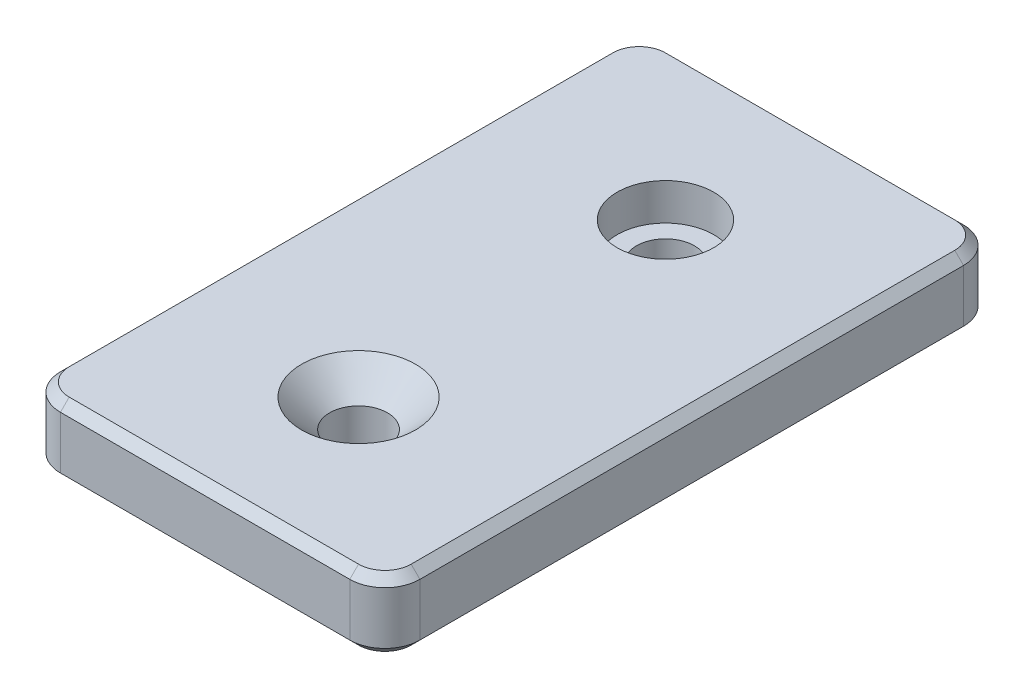
ISO-10303-21;
HEADER;
FILE_DESCRIPTION(('STEP AP214'),'2;1');
FILE_NAME('part.step','',(''),(''),'','','');
FILE_SCHEMA(('AUTOMOTIVE_DESIGN { 1 0 10303 214 1 1 1 1 }'));
ENDSEC;
DATA;
#1=APPLICATION_CONTEXT('core data for automotive mechanical design processes');
#2=APPLICATION_PROTOCOL_DEFINITION('international standard','automotive_design',2000,#1);
#3=PRODUCT_CONTEXT('',#1,'mechanical');
#4=PRODUCT('Part','Part','',(#3));
#5=PRODUCT_RELATED_PRODUCT_CATEGORY('part','',(#4));
#6=PRODUCT_DEFINITION_FORMATION('','',#4);
#7=PRODUCT_DEFINITION_CONTEXT('part definition',#1,'design');
#8=PRODUCT_DEFINITION('design','',#6,#7);
#9=PRODUCT_DEFINITION_SHAPE('','',#8);
#10=(LENGTH_UNIT() NAMED_UNIT(*) SI_UNIT(.MILLI.,.METRE.));
#11=(NAMED_UNIT(*) PLANE_ANGLE_UNIT() SI_UNIT($,.RADIAN.));
#12=(NAMED_UNIT(*) SI_UNIT($,.STERADIAN.) SOLID_ANGLE_UNIT());
#13=UNCERTAINTY_MEASURE_WITH_UNIT(LENGTH_MEASURE(1.E-05),#10,'distance_accuracy_value','');
#14=(GEOMETRIC_REPRESENTATION_CONTEXT(3) GLOBAL_UNCERTAINTY_ASSIGNED_CONTEXT((#13)) GLOBAL_UNIT_ASSIGNED_CONTEXT((#10,
#11,#12)) REPRESENTATION_CONTEXT('',''));
#15=CARTESIAN_POINT('',(0.,0.,0.));
#16=DIRECTION('',(0.,0.,1.));
#17=DIRECTION('',(1.,0.,0.));
#18=AXIS2_PLACEMENT_3D('',#15,#16,#17);
#19=CARTESIAN_POINT('',(0.,0.,-17.5));
#20=DIRECTION('',(0.,1.,0.));
#21=DIRECTION('',(0.,0.,1.));
#22=AXIS2_PLACEMENT_3D('',#19,#20,#21);
#23=CYLINDRICAL_SURFACE('',#22,3.3);
#24=CARTESIAN_POINT('',(0.,0.,-17.5));
#25=DIRECTION('',(0.,1.,0.));
#26=DIRECTION('',(0.,0.,1.));
#27=AXIS2_PLACEMENT_3D('',#24,#25,#26);
#28=CIRCLE('',#27,3.3);
#29=CARTESIAN_POINT('',(0.,0.,-14.2));
#30=VERTEX_POINT('',#29);
#31=EDGE_CURVE('E523',#30,#30,#28,.T.);
#32=ORIENTED_EDGE('',*,*,#31,.F.);
#33=EDGE_LOOP('',(#32));
#34=FACE_BOUND('',#33,.T.);
#35=CARTESIAN_POINT('',(0.,3.8,-17.5));
#36=DIRECTION('',(0.,1.,0.));
#37=DIRECTION('',(0.,0.,1.));
#38=AXIS2_PLACEMENT_3D('',#35,#36,#37);
#39=CIRCLE('',#38,3.3);
#40=CARTESIAN_POINT('',(0.,3.8,-14.2));
#41=VERTEX_POINT('',#40);
#42=EDGE_CURVE('E40',#41,#41,#39,.F.);
#43=ORIENTED_EDGE('',*,*,#42,.F.);
#44=EDGE_LOOP('',(#43));
#45=FACE_BOUND('',#44,.T.);
#46=ADVANCED_FACE('F36',(#34,#45),#23,.F.);
#47=CARTESIAN_POINT('',(20.5,8.,-35.));
#48=DIRECTION('',(-1.,0.,0.));
#49=DIRECTION('',(0.,0.,1.));
#50=AXIS2_PLACEMENT_3D('',#47,#48,#49);
#51=PLANE('',#50);
#52=DIRECTION('',(0.,-1.,0.));
#53=VECTOR('',#52,1.);
#54=CARTESIAN_POINT('',(20.5,8.,31.));
#55=LINE('',#54,#53);
#56=CARTESIAN_POINT('',(20.5,6.99999999999999,31.));
#57=VERTEX_POINT('',#56);
#58=CARTESIAN_POINT('',(20.5,0.999999999999983,31.));
#59=VERTEX_POINT('',#58);
#60=EDGE_CURVE('E488',#57,#59,#55,.T.);
#61=ORIENTED_EDGE('',*,*,#60,.T.);
#62=DIRECTION('',(0.,0.,-1.));
#63=VECTOR('',#62,1.);
#64=CARTESIAN_POINT('',(20.5,0.999999999999983,-35.));
#65=LINE('',#64,#63);
#66=CARTESIAN_POINT('',(20.5,0.999999999999983,-31.));
#67=VERTEX_POINT('',#66);
#68=EDGE_CURVE('E230',#59,#67,#65,.T.);
#69=ORIENTED_EDGE('',*,*,#68,.T.);
#70=DIRECTION('',(0.,-1.,0.));
#71=VECTOR('',#70,1.);
#72=CARTESIAN_POINT('',(20.5,8.,-31.));
#73=LINE('',#72,#71);
#74=CARTESIAN_POINT('',(20.5,6.99999999999999,-31.));
#75=VERTEX_POINT('',#74);
#76=EDGE_CURVE('E200',#67,#75,#73,.F.);
#77=ORIENTED_EDGE('',*,*,#76,.T.);
#78=DIRECTION('',(0.,0.,1.));
#79=VECTOR('',#78,1.);
#80=CARTESIAN_POINT('',(20.5,6.99999999999999,31.));
#81=LINE('',#80,#79);
#82=EDGE_CURVE('E177',#75,#57,#81,.T.);
#83=ORIENTED_EDGE('',*,*,#82,.T.);
#84=EDGE_LOOP('',(#61,#69,#77,#83));
#85=FACE_BOUND('',#84,.T.);
#86=ADVANCED_FACE('F362',(#85),#51,.F.);
#87=CARTESIAN_POINT('',(-20.5,8.,-35.));
#88=DIRECTION('',(0.,0.,1.));
#89=DIRECTION('',(1.,0.,0.));
#90=AXIS2_PLACEMENT_3D('',#87,#88,#89);
#91=PLANE('',#90);
#92=DIRECTION('',(0.,-1.,0.));
#93=VECTOR('',#92,1.);
#94=CARTESIAN_POINT('',(16.5,8.,-35.));
#95=LINE('',#94,#93);
#96=CARTESIAN_POINT('',(16.5,6.99999999999999,-35.));
#97=VERTEX_POINT('',#96);
#98=CARTESIAN_POINT('',(16.5,0.999999999999983,-35.));
#99=VERTEX_POINT('',#98);
#100=EDGE_CURVE('E475',#97,#99,#95,.T.);
#101=ORIENTED_EDGE('',*,*,#100,.T.);
#102=DIRECTION('',(-1.,0.,0.));
#103=VECTOR('',#102,1.);
#104=CARTESIAN_POINT('',(-20.5,0.999999999999983,-35.));
#105=LINE('',#104,#103);
#106=CARTESIAN_POINT('',(-16.5,0.999999999999983,-35.));
#107=VERTEX_POINT('',#106);
#108=EDGE_CURVE('E242',#99,#107,#105,.T.);
#109=ORIENTED_EDGE('',*,*,#108,.T.);
#110=DIRECTION('',(0.,-1.,0.));
#111=VECTOR('',#110,1.);
#112=CARTESIAN_POINT('',(-16.5,8.,-35.));
#113=LINE('',#112,#111);
#114=CARTESIAN_POINT('',(-16.5,6.99999999999999,-35.));
#115=VERTEX_POINT('',#114);
#116=EDGE_CURVE('E478',#107,#115,#113,.F.);
#117=ORIENTED_EDGE('',*,*,#116,.T.);
#118=DIRECTION('',(1.,0.,0.));
#119=VECTOR('',#118,1.);
#120=CARTESIAN_POINT('',(16.5,6.99999999999999,-35.));
#121=LINE('',#120,#119);
#122=EDGE_CURVE('E239',#115,#97,#121,.T.);
#123=ORIENTED_EDGE('',*,*,#122,.T.);
#124=EDGE_LOOP('',(#101,#109,#117,#123));
#125=FACE_BOUND('',#124,.T.);
#126=ADVANCED_FACE('F368',(#125),#91,.F.);
#127=CARTESIAN_POINT('',(-20.5,8.,-35.));
#128=DIRECTION('',(1.,0.,0.));
#129=DIRECTION('',(0.,0.,-1.));
#130=AXIS2_PLACEMENT_3D('',#127,#128,#129);
#131=PLANE('',#130);
#132=DIRECTION('',(0.,-1.,0.));
#133=VECTOR('',#132,1.);
#134=CARTESIAN_POINT('',(-20.5,8.,-31.));
#135=LINE('',#134,#133);
#136=CARTESIAN_POINT('',(-20.5,6.99999999999999,-31.));
#137=VERTEX_POINT('',#136);
#138=CARTESIAN_POINT('',(-20.5,0.999999999999983,-31.));
#139=VERTEX_POINT('',#138);
#140=EDGE_CURVE('E483',#137,#139,#135,.T.);
#141=ORIENTED_EDGE('',*,*,#140,.T.);
#142=DIRECTION('',(0.,0.,1.));
#143=VECTOR('',#142,1.);
#144=CARTESIAN_POINT('',(-20.5,0.999999999999983,-35.));
#145=LINE('',#144,#143);
#146=CARTESIAN_POINT('',(-20.5,0.999999999999983,31.));
#147=VERTEX_POINT('',#146);
#148=EDGE_CURVE('E254',#139,#147,#145,.T.);
#149=ORIENTED_EDGE('',*,*,#148,.T.);
#150=DIRECTION('',(0.,-1.,0.));
#151=VECTOR('',#150,1.);
#152=CARTESIAN_POINT('',(-20.5,8.,31.));
#153=LINE('',#152,#151);
#154=CARTESIAN_POINT('',(-20.5,6.99999999999999,31.));
#155=VERTEX_POINT('',#154);
#156=EDGE_CURVE('E310',#147,#155,#153,.F.);
#157=ORIENTED_EDGE('',*,*,#156,.T.);
#158=DIRECTION('',(0.,0.,-1.));
#159=VECTOR('',#158,1.);
#160=CARTESIAN_POINT('',(-20.5,6.99999999999999,-31.));
#161=LINE('',#160,#159);
#162=EDGE_CURVE('E251',#155,#137,#161,.T.);
#163=ORIENTED_EDGE('',*,*,#162,.T.);
#164=EDGE_LOOP('',(#141,#149,#157,#163));
#165=FACE_BOUND('',#164,.T.);
#166=ADVANCED_FACE('F386',(#165),#131,.F.);
#167=CARTESIAN_POINT('',(-20.5,8.,35.));
#168=DIRECTION('',(0.,0.,-1.));
#169=DIRECTION('',(-1.,0.,0.));
#170=AXIS2_PLACEMENT_3D('',#167,#168,#169);
#171=PLANE('',#170);
#172=DIRECTION('',(0.,-1.,0.));
#173=VECTOR('',#172,1.);
#174=CARTESIAN_POINT('',(-16.5,8.,35.));
#175=LINE('',#174,#173);
#176=CARTESIAN_POINT('',(-16.5,6.99999999999999,35.));
#177=VERTEX_POINT('',#176);
#178=CARTESIAN_POINT('',(-16.5,0.999999999999983,35.));
#179=VERTEX_POINT('',#178);
#180=EDGE_CURVE('E186',#177,#179,#175,.T.);
#181=ORIENTED_EDGE('',*,*,#180,.T.);
#182=DIRECTION('',(1.,0.,0.));
#183=VECTOR('',#182,1.);
#184=CARTESIAN_POINT('',(-20.5,0.999999999999983,35.));
#185=LINE('',#184,#183);
#186=CARTESIAN_POINT('',(16.5,0.999999999999983,35.));
#187=VERTEX_POINT('',#186);
#188=EDGE_CURVE('E158',#179,#187,#185,.T.);
#189=ORIENTED_EDGE('',*,*,#188,.T.);
#190=DIRECTION('',(0.,-1.,0.));
#191=VECTOR('',#190,1.);
#192=CARTESIAN_POINT('',(16.5,8.,35.));
#193=LINE('',#192,#191);
#194=CARTESIAN_POINT('',(16.5,6.99999999999999,35.));
#195=VERTEX_POINT('',#194);
#196=EDGE_CURVE('E184',#187,#195,#193,.F.);
#197=ORIENTED_EDGE('',*,*,#196,.T.);
#198=DIRECTION('',(-1.,0.,0.));
#199=VECTOR('',#198,1.);
#200=CARTESIAN_POINT('',(-16.5,6.99999999999999,35.));
#201=LINE('',#200,#199);
#202=EDGE_CURVE('E190',#195,#177,#201,.T.);
#203=ORIENTED_EDGE('',*,*,#202,.T.);
#204=EDGE_LOOP('',(#181,#189,#197,#203));
#205=FACE_BOUND('',#204,.T.);
#206=ADVANCED_FACE('F183',(#205),#171,.F.);
#207=CARTESIAN_POINT('',(0.,8.,0.));
#208=DIRECTION('',(0.,1.,0.));
#209=DIRECTION('',(0.,0.,1.));
#210=AXIS2_PLACEMENT_3D('',#207,#208,#209);
#211=PLANE('',#210);
#212=CARTESIAN_POINT('',(0.,8.,-17.5));
#213=DIRECTION('',(0.,1.,0.));
#214=DIRECTION('',(0.,0.,1.));
#215=AXIS2_PLACEMENT_3D('',#212,#213,#214);
#216=CIRCLE('',#215,5.5);
#217=CARTESIAN_POINT('',(0.,8.,-12.));
#218=VERTEX_POINT('',#217);
#219=EDGE_CURVE('E530',#218,#218,#216,.T.);
#220=ORIENTED_EDGE('',*,*,#219,.F.);
#221=EDGE_LOOP('',(#220));
#222=FACE_BOUND('',#221,.T.);
#223=CARTESIAN_POINT('',(0.,8.,17.5));
#224=DIRECTION('',(0.,1.,0.));
#225=DIRECTION('',(0.,0.,1.));
#226=AXIS2_PLACEMENT_3D('',#223,#224,#225);
#227=CIRCLE('',#226,6.50000000000001);
#228=CARTESIAN_POINT('',(0.,8.,24.));
#229=VERTEX_POINT('',#228);
#230=EDGE_CURVE('E11',#229,#229,#227,.F.);
#231=ORIENTED_EDGE('',*,*,#230,.T.);
#232=EDGE_LOOP('',(#231));
#233=FACE_BOUND('',#232,.T.);
#234=DIRECTION('',(1.,0.,0.));
#235=VECTOR('',#234,1.);
#236=CARTESIAN_POINT('',(16.5,8.,34.));
#237=LINE('',#236,#235);
#238=CARTESIAN_POINT('',(-16.5,8.,34.));
#239=VERTEX_POINT('',#238);
#240=CARTESIAN_POINT('',(16.5,8.,34.));
#241=VERTEX_POINT('',#240);
#242=EDGE_CURVE('E263',#239,#241,#237,.T.);
#243=ORIENTED_EDGE('',*,*,#242,.T.);
#244=CARTESIAN_POINT('',(16.5,8.,31.));
#245=DIRECTION('',(0.,1.,0.));
#246=DIRECTION('',(0.,0.,1.));
#247=AXIS2_PLACEMENT_3D('',#244,#245,#246);
#248=CIRCLE('',#247,3.00000000000001);
#249=CARTESIAN_POINT('',(19.5,8.,31.));
#250=VERTEX_POINT('',#249);
#251=EDGE_CURVE('E283',#241,#250,#248,.T.);
#252=ORIENTED_EDGE('',*,*,#251,.T.);
#253=DIRECTION('',(0.,0.,-1.));
#254=VECTOR('',#253,1.);
#255=CARTESIAN_POINT('',(19.5,8.,-31.));
#256=LINE('',#255,#254);
#257=CARTESIAN_POINT('',(19.5,8.,-31.));
#258=VERTEX_POINT('',#257);
#259=EDGE_CURVE('E60',#250,#258,#256,.T.);
#260=ORIENTED_EDGE('',*,*,#259,.T.);
#261=CARTESIAN_POINT('',(16.5,8.,-31.));
#262=DIRECTION('',(0.,1.,0.));
#263=DIRECTION('',(0.,0.,1.));
#264=AXIS2_PLACEMENT_3D('',#261,#262,#263);
#265=CIRCLE('',#264,3.00000000000001);
#266=CARTESIAN_POINT('',(16.5,8.,-34.));
#267=VERTEX_POINT('',#266);
#268=EDGE_CURVE('E278',#258,#267,#265,.T.);
#269=ORIENTED_EDGE('',*,*,#268,.T.);
#270=DIRECTION('',(-1.,0.,0.));
#271=VECTOR('',#270,1.);
#272=CARTESIAN_POINT('',(-16.5,8.,-34.));
#273=LINE('',#272,#271);
#274=CARTESIAN_POINT('',(-16.5,8.,-34.));
#275=VERTEX_POINT('',#274);
#276=EDGE_CURVE('E275',#267,#275,#273,.T.);
#277=ORIENTED_EDGE('',*,*,#276,.T.);
#278=CARTESIAN_POINT('',(-16.5,8.,-31.));
#279=DIRECTION('',(0.,1.,0.));
#280=DIRECTION('',(0.,0.,1.));
#281=AXIS2_PLACEMENT_3D('',#278,#279,#280);
#282=CIRCLE('',#281,3.00000000000001);
#283=CARTESIAN_POINT('',(-19.5,8.,-31.));
#284=VERTEX_POINT('',#283);
#285=EDGE_CURVE('E272',#275,#284,#282,.T.);
#286=ORIENTED_EDGE('',*,*,#285,.T.);
#287=DIRECTION('',(0.,0.,1.));
#288=VECTOR('',#287,1.);
#289=CARTESIAN_POINT('',(-19.5,8.,31.));
#290=LINE('',#289,#288);
#291=CARTESIAN_POINT('',(-19.5,8.,31.));
#292=VERTEX_POINT('',#291);
#293=EDGE_CURVE('E269',#284,#292,#290,.T.);
#294=ORIENTED_EDGE('',*,*,#293,.T.);
#295=CARTESIAN_POINT('',(-16.5,8.,31.));
#296=DIRECTION('',(0.,1.,0.));
#297=DIRECTION('',(0.,0.,1.));
#298=AXIS2_PLACEMENT_3D('',#295,#296,#297);
#299=CIRCLE('',#298,3.00000000000001);
#300=EDGE_CURVE('E266',#292,#239,#299,.T.);
#301=ORIENTED_EDGE('',*,*,#300,.T.);
#302=EDGE_LOOP('',(#243,#252,#260,#269,#277,#286,#294,#301));
#303=FACE_BOUND('',#302,.T.);
#304=ADVANCED_FACE('F375',(#222,#233,#303),#211,.T.);
#305=CARTESIAN_POINT('',(0.,0.,0.));
#306=DIRECTION('',(0.,1.,0.));
#307=DIRECTION('',(0.,0.,1.));
#308=AXIS2_PLACEMENT_3D('',#305,#306,#307);
#309=PLANE('',#308);
#310=CARTESIAN_POINT('',(0.,0.,17.5));
#311=DIRECTION('',(0.,1.,0.));
#312=DIRECTION('',(0.,0.,1.));
#313=AXIS2_PLACEMENT_3D('',#310,#311,#312);
#314=CIRCLE('',#313,3.3);
#315=CARTESIAN_POINT('',(0.,0.,20.8));
#316=VERTEX_POINT('',#315);
#317=EDGE_CURVE('E314',#316,#316,#314,.T.);
#318=ORIENTED_EDGE('',*,*,#317,.T.);
#319=EDGE_LOOP('',(#318));
#320=FACE_BOUND('',#319,.T.);
#321=ORIENTED_EDGE('',*,*,#31,.T.);
#322=EDGE_LOOP('',(#321));
#323=FACE_BOUND('',#322,.T.);
#324=CARTESIAN_POINT('',(16.5,0.,31.));
#325=DIRECTION('',(0.,1.,0.));
#326=DIRECTION('',(0.,0.,1.));
#327=AXIS2_PLACEMENT_3D('',#324,#325,#326);
#328=CIRCLE('',#327,3.00000000000002);
#329=CARTESIAN_POINT('',(19.5,0.,31.));
#330=VERTEX_POINT('',#329);
#331=CARTESIAN_POINT('',(16.5,0.,34.));
#332=VERTEX_POINT('',#331);
#333=EDGE_CURVE('E221',#330,#332,#328,.F.);
#334=ORIENTED_EDGE('',*,*,#333,.T.);
#335=DIRECTION('',(-1.,0.,0.));
#336=VECTOR('',#335,1.);
#337=CARTESIAN_POINT('',(0.,0.,34.));
#338=LINE('',#337,#336);
#339=CARTESIAN_POINT('',(-16.5,0.,34.));
#340=VERTEX_POINT('',#339);
#341=EDGE_CURVE('E160',#332,#340,#338,.T.);
#342=ORIENTED_EDGE('',*,*,#341,.T.);
#343=CARTESIAN_POINT('',(-16.5,0.,31.));
#344=DIRECTION('',(0.,1.,0.));
#345=DIRECTION('',(0.,0.,1.));
#346=AXIS2_PLACEMENT_3D('',#343,#344,#345);
#347=CIRCLE('',#346,3.00000000000002);
#348=CARTESIAN_POINT('',(-19.5,0.,31.));
#349=VERTEX_POINT('',#348);
#350=EDGE_CURVE('E189',#340,#349,#347,.F.);
#351=ORIENTED_EDGE('',*,*,#350,.T.);
#352=DIRECTION('',(0.,0.,-1.));
#353=VECTOR('',#352,1.);
#354=CARTESIAN_POINT('',(-19.5,0.,0.));
#355=LINE('',#354,#353);
#356=CARTESIAN_POINT('',(-19.5,0.,-31.));
#357=VERTEX_POINT('',#356);
#358=EDGE_CURVE('E206',#349,#357,#355,.T.);
#359=ORIENTED_EDGE('',*,*,#358,.T.);
#360=CARTESIAN_POINT('',(-16.5,0.,-31.));
#361=DIRECTION('',(0.,1.,0.));
#362=DIRECTION('',(0.,0.,1.));
#363=AXIS2_PLACEMENT_3D('',#360,#361,#362);
#364=CIRCLE('',#363,3.00000000000001);
#365=CARTESIAN_POINT('',(-16.5,0.,-34.));
#366=VERTEX_POINT('',#365);
#367=EDGE_CURVE('E209',#357,#366,#364,.F.);
#368=ORIENTED_EDGE('',*,*,#367,.T.);
#369=DIRECTION('',(1.,0.,0.));
#370=VECTOR('',#369,1.);
#371=CARTESIAN_POINT('',(0.,0.,-34.));
#372=LINE('',#371,#370);
#373=CARTESIAN_POINT('',(16.5,0.,-34.));
#374=VERTEX_POINT('',#373);
#375=EDGE_CURVE('E212',#366,#374,#372,.T.);
#376=ORIENTED_EDGE('',*,*,#375,.T.);
#377=CARTESIAN_POINT('',(16.5,0.,-31.));
#378=DIRECTION('',(0.,1.,0.));
#379=DIRECTION('',(0.,0.,1.));
#380=AXIS2_PLACEMENT_3D('',#377,#378,#379);
#381=CIRCLE('',#380,3.00000000000002);
#382=CARTESIAN_POINT('',(19.5,0.,-31.));
#383=VERTEX_POINT('',#382);
#384=EDGE_CURVE('E215',#374,#383,#381,.F.);
#385=ORIENTED_EDGE('',*,*,#384,.T.);
#386=DIRECTION('',(0.,0.,1.));
#387=VECTOR('',#386,1.);
#388=CARTESIAN_POINT('',(19.5,0.,0.));
#389=LINE('',#388,#387);
#390=EDGE_CURVE('E218',#383,#330,#389,.T.);
#391=ORIENTED_EDGE('',*,*,#390,.T.);
#392=EDGE_LOOP('',(#334,#342,#351,#359,#368,#376,#385,#391));
#393=FACE_BOUND('',#392,.T.);
#394=ADVANCED_FACE('F378',(#320,#323,#393),#309,.F.);
#395=CARTESIAN_POINT('',(-16.5,8.,-31.));
#396=DIRECTION('',(0.,-1.,0.));
#397=DIRECTION('',(0.,0.,-1.));
#398=AXIS2_PLACEMENT_3D('',#395,#396,#397);
#399=CYLINDRICAL_SURFACE('',#398,4.);
#400=ORIENTED_EDGE('',*,*,#116,.F.);
#401=CARTESIAN_POINT('',(-16.5,0.999999999999983,-31.));
#402=DIRECTION('',(0.,1.,0.));
#403=DIRECTION('',(0.,0.,1.));
#404=AXIS2_PLACEMENT_3D('',#401,#402,#403);
#405=CIRCLE('',#404,4.);
#406=EDGE_CURVE('E248',#107,#139,#405,.T.);
#407=ORIENTED_EDGE('',*,*,#406,.T.);
#408=ORIENTED_EDGE('',*,*,#140,.F.);
#409=CARTESIAN_POINT('',(-16.5,6.99999999999999,-31.));
#410=DIRECTION('',(0.,1.,0.));
#411=DIRECTION('',(0.,0.,1.));
#412=AXIS2_PLACEMENT_3D('',#409,#410,#411);
#413=CIRCLE('',#412,4.);
#414=EDGE_CURVE('E245',#137,#115,#413,.F.);
#415=ORIENTED_EDGE('',*,*,#414,.T.);
#416=EDGE_LOOP('',(#400,#407,#408,#415));
#417=FACE_BOUND('',#416,.T.);
#418=ADVANCED_FACE('F382',(#417),#399,.T.);
#419=CARTESIAN_POINT('',(16.5,8.,-31.));
#420=DIRECTION('',(0.,-1.,0.));
#421=DIRECTION('',(0.,0.,-1.));
#422=AXIS2_PLACEMENT_3D('',#419,#420,#421);
#423=CYLINDRICAL_SURFACE('',#422,4.);
#424=ORIENTED_EDGE('',*,*,#76,.F.);
#425=CARTESIAN_POINT('',(16.5,0.999999999999983,-31.));
#426=DIRECTION('',(0.,1.,0.));
#427=DIRECTION('',(0.,0.,1.));
#428=AXIS2_PLACEMENT_3D('',#425,#426,#427);
#429=CIRCLE('',#428,4.);
#430=EDGE_CURVE('E236',#67,#99,#429,.T.);
#431=ORIENTED_EDGE('',*,*,#430,.T.);
#432=ORIENTED_EDGE('',*,*,#100,.F.);
#433=CARTESIAN_POINT('',(16.5,6.99999999999999,-31.));
#434=DIRECTION('',(0.,1.,0.));
#435=DIRECTION('',(0.,0.,1.));
#436=AXIS2_PLACEMENT_3D('',#433,#434,#435);
#437=CIRCLE('',#436,4.);
#438=EDGE_CURVE('E233',#97,#75,#437,.F.);
#439=ORIENTED_EDGE('',*,*,#438,.T.);
#440=EDGE_LOOP('',(#424,#431,#432,#439));
#441=FACE_BOUND('',#440,.T.);
#442=ADVANCED_FACE('F395',(#441),#423,.T.);
#443=CARTESIAN_POINT('',(16.5,8.,31.));
#444=DIRECTION('',(0.,-1.,0.));
#445=DIRECTION('',(0.,0.,-1.));
#446=AXIS2_PLACEMENT_3D('',#443,#444,#445);
#447=CYLINDRICAL_SURFACE('',#446,4.);
#448=ORIENTED_EDGE('',*,*,#196,.F.);
#449=CARTESIAN_POINT('',(16.5,0.999999999999983,31.));
#450=DIRECTION('',(0.,1.,0.));
#451=DIRECTION('',(0.,0.,1.));
#452=AXIS2_PLACEMENT_3D('',#449,#450,#451);
#453=CIRCLE('',#452,4.);
#454=EDGE_CURVE('E168',#187,#59,#453,.T.);
#455=ORIENTED_EDGE('',*,*,#454,.T.);
#456=ORIENTED_EDGE('',*,*,#60,.F.);
#457=CARTESIAN_POINT('',(16.5,6.99999999999999,31.));
#458=DIRECTION('',(0.,1.,0.));
#459=DIRECTION('',(0.,0.,1.));
#460=AXIS2_PLACEMENT_3D('',#457,#458,#459);
#461=CIRCLE('',#460,4.);
#462=EDGE_CURVE('E178',#57,#195,#461,.F.);
#463=ORIENTED_EDGE('',*,*,#462,.T.);
#464=EDGE_LOOP('',(#448,#455,#456,#463));
#465=FACE_BOUND('',#464,.T.);
#466=ADVANCED_FACE('F193',(#465),#447,.T.);
#467=CARTESIAN_POINT('',(-16.5,8.,31.));
#468=DIRECTION('',(0.,-1.,0.));
#469=DIRECTION('',(0.,0.,-1.));
#470=AXIS2_PLACEMENT_3D('',#467,#468,#469);
#471=CYLINDRICAL_SURFACE('',#470,4.);
#472=ORIENTED_EDGE('',*,*,#156,.F.);
#473=CARTESIAN_POINT('',(-16.5,0.999999999999983,31.));
#474=DIRECTION('',(0.,1.,0.));
#475=DIRECTION('',(0.,0.,1.));
#476=AXIS2_PLACEMENT_3D('',#473,#474,#475);
#477=CIRCLE('',#476,4.);
#478=EDGE_CURVE('E260',#147,#179,#477,.T.);
#479=ORIENTED_EDGE('',*,*,#478,.T.);
#480=ORIENTED_EDGE('',*,*,#180,.F.);
#481=CARTESIAN_POINT('',(-16.5,6.99999999999999,31.));
#482=DIRECTION('',(0.,1.,0.));
#483=DIRECTION('',(0.,0.,1.));
#484=AXIS2_PLACEMENT_3D('',#481,#482,#483);
#485=CIRCLE('',#484,4.);
#486=EDGE_CURVE('E257',#177,#155,#485,.F.);
#487=ORIENTED_EDGE('',*,*,#486,.T.);
#488=EDGE_LOOP('',(#472,#479,#480,#487));
#489=FACE_BOUND('',#488,.T.);
#490=ADVANCED_FACE('F402',(#489),#471,.T.);
#491=CARTESIAN_POINT('',(-20.5,0.999999999999983,-35.));
#492=DIRECTION('',(0.,0.707106781186549,0.707106781186546));
#493=DIRECTION('',(-1.,0.,0.));
#494=AXIS2_PLACEMENT_3D('',#491,#492,#493);
#495=PLANE('',#494);
#496=DIRECTION('',(0.,0.707106781186546,-0.707106781186549));
#497=VECTOR('',#496,1.);
#498=CARTESIAN_POINT('',(16.5,0.,-34.));
#499=LINE('',#498,#497);
#500=EDGE_CURVE('E302',#374,#99,#499,.T.);
#501=ORIENTED_EDGE('',*,*,#500,.F.);
#502=ORIENTED_EDGE('',*,*,#375,.F.);
#503=DIRECTION('',(0.,-0.707106781186546,0.707106781186549));
#504=VECTOR('',#503,1.);
#505=CARTESIAN_POINT('',(-16.5,0.999999999999983,-35.));
#506=LINE('',#505,#504);
#507=EDGE_CURVE('E306',#107,#366,#506,.T.);
#508=ORIENTED_EDGE('',*,*,#507,.F.);
#509=ORIENTED_EDGE('',*,*,#108,.F.);
#510=EDGE_LOOP('',(#501,#502,#508,#509));
#511=FACE_BOUND('',#510,.T.);
#512=ADVANCED_FACE('F405',(#511),#495,.F.);
#513=CARTESIAN_POINT('',(-16.5,0.,-31.));
#514=DIRECTION('',(0.,1.,0.));
#515=DIRECTION('',(0.,0.,1.));
#516=AXIS2_PLACEMENT_3D('',#513,#514,#515);
#517=CONICAL_SURFACE('',#516,3.00000000000001,0.78539816339745);
#518=ORIENTED_EDGE('',*,*,#507,.T.);
#519=ORIENTED_EDGE('',*,*,#367,.F.);
#520=DIRECTION('',(0.707106781186549,-0.707106781186546,0.));
#521=VECTOR('',#520,1.);
#522=CARTESIAN_POINT('',(-20.5,0.999999999999983,-31.));
#523=LINE('',#522,#521);
#524=EDGE_CURVE('E298',#139,#357,#523,.T.);
#525=ORIENTED_EDGE('',*,*,#524,.F.);
#526=ORIENTED_EDGE('',*,*,#406,.F.);
#527=EDGE_LOOP('',(#518,#519,#525,#526));
#528=FACE_BOUND('',#527,.T.);
#529=ADVANCED_FACE('F427',(#528),#517,.T.);
#530=CARTESIAN_POINT('',(16.5,0.,-31.));
#531=DIRECTION('',(0.,1.,0.));
#532=DIRECTION('',(0.,0.,1.));
#533=AXIS2_PLACEMENT_3D('',#530,#531,#532);
#534=CONICAL_SURFACE('',#533,3.00000000000002,0.785398163397449);
#535=ORIENTED_EDGE('',*,*,#500,.T.);
#536=ORIENTED_EDGE('',*,*,#430,.F.);
#537=DIRECTION('',(0.707106781186548,0.707106781186547,0.));
#538=VECTOR('',#537,1.);
#539=CARTESIAN_POINT('',(19.5,0.,-31.));
#540=LINE('',#539,#538);
#541=EDGE_CURVE('E294',#383,#67,#540,.T.);
#542=ORIENTED_EDGE('',*,*,#541,.F.);
#543=ORIENTED_EDGE('',*,*,#384,.F.);
#544=EDGE_LOOP('',(#535,#536,#542,#543));
#545=FACE_BOUND('',#544,.T.);
#546=ADVANCED_FACE('F423',(#545),#534,.T.);
#547=CARTESIAN_POINT('',(-20.5,0.999999999999983,-35.));
#548=DIRECTION('',(0.707106781186547,0.707106781186548,0.));
#549=DIRECTION('',(0.,0.,1.));
#550=AXIS2_PLACEMENT_3D('',#547,#548,#549);
#551=PLANE('',#550);
#552=ORIENTED_EDGE('',*,*,#524,.T.);
#553=ORIENTED_EDGE('',*,*,#358,.F.);
#554=DIRECTION('',(0.707106781186548,-0.707106781186547,0.));
#555=VECTOR('',#554,1.);
#556=CARTESIAN_POINT('',(-20.5,0.999999999999983,31.));
#557=LINE('',#556,#555);
#558=EDGE_CURVE('E290',#147,#349,#557,.T.);
#559=ORIENTED_EDGE('',*,*,#558,.F.);
#560=ORIENTED_EDGE('',*,*,#148,.F.);
#561=EDGE_LOOP('',(#552,#553,#559,#560));
#562=FACE_BOUND('',#561,.T.);
#563=ADVANCED_FACE('F419',(#562),#551,.F.);
#564=CARTESIAN_POINT('',(20.5,0.999999999999983,-35.));
#565=DIRECTION('',(-0.707106781186547,0.707106781186548,0.));
#566=DIRECTION('',(0.,0.,-1.));
#567=AXIS2_PLACEMENT_3D('',#564,#565,#566);
#568=PLANE('',#567);
#569=ORIENTED_EDGE('',*,*,#541,.T.);
#570=ORIENTED_EDGE('',*,*,#68,.F.);
#571=DIRECTION('',(0.707106781186548,0.707106781186547,0.));
#572=VECTOR('',#571,1.);
#573=CARTESIAN_POINT('',(19.5,0.,31.));
#574=LINE('',#573,#572);
#575=EDGE_CURVE('E171',#330,#59,#574,.T.);
#576=ORIENTED_EDGE('',*,*,#575,.F.);
#577=ORIENTED_EDGE('',*,*,#390,.F.);
#578=EDGE_LOOP('',(#569,#570,#576,#577));
#579=FACE_BOUND('',#578,.T.);
#580=ADVANCED_FACE('F415',(#579),#568,.F.);
#581=CARTESIAN_POINT('',(-16.5,0.,31.));
#582=DIRECTION('',(0.,1.,0.));
#583=DIRECTION('',(0.,0.,1.));
#584=AXIS2_PLACEMENT_3D('',#581,#582,#583);
#585=CONICAL_SURFACE('',#584,3.00000000000002,0.785398163397449);
#586=ORIENTED_EDGE('',*,*,#558,.T.);
#587=ORIENTED_EDGE('',*,*,#350,.F.);
#588=DIRECTION('',(0.,-0.707106781186546,-0.707106781186549));
#589=VECTOR('',#588,1.);
#590=CARTESIAN_POINT('',(-16.5,0.999999999999983,35.));
#591=LINE('',#590,#589);
#592=EDGE_CURVE('E164',#179,#340,#591,.T.);
#593=ORIENTED_EDGE('',*,*,#592,.F.);
#594=ORIENTED_EDGE('',*,*,#478,.F.);
#595=EDGE_LOOP('',(#586,#587,#593,#594));
#596=FACE_BOUND('',#595,.T.);
#597=ADVANCED_FACE('F412',(#596),#585,.T.);
#598=CARTESIAN_POINT('',(16.5,0.,31.));
#599=DIRECTION('',(0.,1.,0.));
#600=DIRECTION('',(0.,0.,1.));
#601=AXIS2_PLACEMENT_3D('',#598,#599,#600);
#602=CONICAL_SURFACE('',#601,3.00000000000002,0.785398163397449);
#603=ORIENTED_EDGE('',*,*,#575,.T.);
#604=ORIENTED_EDGE('',*,*,#454,.F.);
#605=DIRECTION('',(0.,0.707106781186546,0.707106781186549));
#606=VECTOR('',#605,1.);
#607=CARTESIAN_POINT('',(16.5,0.,34.));
#608=LINE('',#607,#606);
#609=EDGE_CURVE('E154',#332,#187,#608,.T.);
#610=ORIENTED_EDGE('',*,*,#609,.F.);
#611=ORIENTED_EDGE('',*,*,#333,.F.);
#612=EDGE_LOOP('',(#603,#604,#610,#611));
#613=FACE_BOUND('',#612,.T.);
#614=ADVANCED_FACE('F169',(#613),#602,.T.);
#615=CARTESIAN_POINT('',(-20.5,0.999999999999983,35.));
#616=DIRECTION('',(0.,0.707106781186549,-0.707106781186546));
#617=DIRECTION('',(1.,0.,0.));
#618=AXIS2_PLACEMENT_3D('',#615,#616,#617);
#619=PLANE('',#618);
#620=ORIENTED_EDGE('',*,*,#592,.T.);
#621=ORIENTED_EDGE('',*,*,#341,.F.);
#622=ORIENTED_EDGE('',*,*,#609,.T.);
#623=ORIENTED_EDGE('',*,*,#188,.F.);
#624=EDGE_LOOP('',(#620,#621,#622,#623));
#625=FACE_BOUND('',#624,.T.);
#626=ADVANCED_FACE('F156',(#625),#619,.F.);
#627=CARTESIAN_POINT('',(-16.5,8.,-31.));
#628=DIRECTION('',(0.,-1.,0.));
#629=DIRECTION('',(0.,0.,-1.));
#630=AXIS2_PLACEMENT_3D('',#627,#628,#629);
#631=CONICAL_SURFACE('',#630,3.00000000000001,0.785398163397441);
#632=DIRECTION('',(0.,0.707106781186552,0.707106781186543));
#633=VECTOR('',#632,1.);
#634=CARTESIAN_POINT('',(-16.5,6.99999999999999,-35.));
#635=LINE('',#634,#633);
#636=EDGE_CURVE('E333',#115,#275,#635,.T.);
#637=ORIENTED_EDGE('',*,*,#636,.F.);
#638=ORIENTED_EDGE('',*,*,#414,.F.);
#639=DIRECTION('',(-0.707106781186543,-0.707106781186552,0.));
#640=VECTOR('',#639,1.);
#641=CARTESIAN_POINT('',(-19.5,8.,-31.));
#642=LINE('',#641,#640);
#643=EDGE_CURVE('E165',#284,#137,#642,.T.);
#644=ORIENTED_EDGE('',*,*,#643,.F.);
#645=ORIENTED_EDGE('',*,*,#285,.F.);
#646=EDGE_LOOP('',(#637,#638,#644,#645));
#647=FACE_BOUND('',#646,.T.);
#648=ADVANCED_FACE('F409',(#647),#631,.T.);
#649=CARTESIAN_POINT('',(-19.5,8.,0.));
#650=DIRECTION('',(-0.707106781186552,0.707106781186543,0.));
#651=DIRECTION('',(0.,0.,-1.));
#652=AXIS2_PLACEMENT_3D('',#649,#650,#651);
#653=PLANE('',#652);
#654=ORIENTED_EDGE('',*,*,#643,.T.);
#655=ORIENTED_EDGE('',*,*,#162,.F.);
#656=DIRECTION('',(-0.707106781186543,-0.707106781186552,0.));
#657=VECTOR('',#656,1.);
#658=CARTESIAN_POINT('',(-19.5,8.,31.));
#659=LINE('',#658,#657);
#660=EDGE_CURVE('E329',#292,#155,#659,.T.);
#661=ORIENTED_EDGE('',*,*,#660,.F.);
#662=ORIENTED_EDGE('',*,*,#293,.F.);
#663=EDGE_LOOP('',(#654,#655,#661,#662));
#664=FACE_BOUND('',#663,.T.);
#665=ADVANCED_FACE('F456',(#664),#653,.T.);
#666=CARTESIAN_POINT('',(0.,8.,-34.));
#667=DIRECTION('',(0.,0.707106781186543,-0.707106781186552));
#668=DIRECTION('',(1.,0.,0.));
#669=AXIS2_PLACEMENT_3D('',#666,#667,#668);
#670=PLANE('',#669);
#671=ORIENTED_EDGE('',*,*,#636,.T.);
#672=ORIENTED_EDGE('',*,*,#276,.F.);
#673=DIRECTION('',(0.,0.707106781186552,0.707106781186543));
#674=VECTOR('',#673,1.);
#675=CARTESIAN_POINT('',(16.5,6.99999999999999,-35.));
#676=LINE('',#675,#674);
#677=EDGE_CURVE('E325',#97,#267,#676,.T.);
#678=ORIENTED_EDGE('',*,*,#677,.F.);
#679=ORIENTED_EDGE('',*,*,#122,.F.);
#680=EDGE_LOOP('',(#671,#672,#678,#679));
#681=FACE_BOUND('',#680,.T.);
#682=ADVANCED_FACE('F452',(#681),#670,.T.);
#683=CARTESIAN_POINT('',(-16.5,8.,31.));
#684=DIRECTION('',(0.,-1.,0.));
#685=DIRECTION('',(0.,0.,-1.));
#686=AXIS2_PLACEMENT_3D('',#683,#684,#685);
#687=CONICAL_SURFACE('',#686,3.00000000000001,0.785398163397441);
#688=ORIENTED_EDGE('',*,*,#660,.T.);
#689=ORIENTED_EDGE('',*,*,#486,.F.);
#690=DIRECTION('',(0.,-0.707106781186552,0.707106781186543));
#691=VECTOR('',#690,1.);
#692=CARTESIAN_POINT('',(-16.5,8.,34.));
#693=LINE('',#692,#691);
#694=EDGE_CURVE('E321',#239,#177,#693,.T.);
#695=ORIENTED_EDGE('',*,*,#694,.F.);
#696=ORIENTED_EDGE('',*,*,#300,.F.);
#697=EDGE_LOOP('',(#688,#689,#695,#696));
#698=FACE_BOUND('',#697,.T.);
#699=ADVANCED_FACE('F448',(#698),#687,.T.);
#700=CARTESIAN_POINT('',(16.5,8.,-31.));
#701=DIRECTION('',(0.,-1.,0.));
#702=DIRECTION('',(0.,0.,-1.));
#703=AXIS2_PLACEMENT_3D('',#700,#701,#702);
#704=CONICAL_SURFACE('',#703,3.00000000000001,0.785398163397441);
#705=ORIENTED_EDGE('',*,*,#677,.T.);
#706=ORIENTED_EDGE('',*,*,#268,.F.);
#707=DIRECTION('',(-0.707106781186543,0.707106781186552,0.));
#708=VECTOR('',#707,1.);
#709=CARTESIAN_POINT('',(20.5,6.99999999999999,-31.));
#710=LINE('',#709,#708);
#711=EDGE_CURVE('E317',#75,#258,#710,.T.);
#712=ORIENTED_EDGE('',*,*,#711,.F.);
#713=ORIENTED_EDGE('',*,*,#438,.F.);
#714=EDGE_LOOP('',(#705,#706,#712,#713));
#715=FACE_BOUND('',#714,.T.);
#716=ADVANCED_FACE('F444',(#715),#704,.T.);
#717=CARTESIAN_POINT('',(0.,8.,34.));
#718=DIRECTION('',(0.,0.707106781186543,0.707106781186552));
#719=DIRECTION('',(-1.,0.,0.));
#720=AXIS2_PLACEMENT_3D('',#717,#718,#719);
#721=PLANE('',#720);
#722=ORIENTED_EDGE('',*,*,#694,.T.);
#723=ORIENTED_EDGE('',*,*,#202,.F.);
#724=DIRECTION('',(0.,-0.707106781186552,0.707106781186543));
#725=VECTOR('',#724,1.);
#726=CARTESIAN_POINT('',(16.5,8.,34.));
#727=LINE('',#726,#725);
#728=EDGE_CURVE('E313',#241,#195,#727,.T.);
#729=ORIENTED_EDGE('',*,*,#728,.F.);
#730=ORIENTED_EDGE('',*,*,#242,.F.);
#731=EDGE_LOOP('',(#722,#723,#729,#730));
#732=FACE_BOUND('',#731,.T.);
#733=ADVANCED_FACE('F440',(#732),#721,.T.);
#734=CARTESIAN_POINT('',(19.5,8.,0.));
#735=DIRECTION('',(0.707106781186552,0.707106781186543,0.));
#736=DIRECTION('',(0.,0.,1.));
#737=AXIS2_PLACEMENT_3D('',#734,#735,#736);
#738=PLANE('',#737);
#739=ORIENTED_EDGE('',*,*,#711,.T.);
#740=ORIENTED_EDGE('',*,*,#259,.F.);
#741=DIRECTION('',(-0.707106781186543,0.707106781186552,0.));
#742=VECTOR('',#741,1.);
#743=CARTESIAN_POINT('',(20.5,6.99999999999999,31.));
#744=LINE('',#743,#742);
#745=EDGE_CURVE('E53',#57,#250,#744,.T.);
#746=ORIENTED_EDGE('',*,*,#745,.F.);
#747=ORIENTED_EDGE('',*,*,#82,.F.);
#748=EDGE_LOOP('',(#739,#740,#746,#747));
#749=FACE_BOUND('',#748,.T.);
#750=ADVANCED_FACE('F437',(#749),#738,.T.);
#751=CARTESIAN_POINT('',(16.5,8.,31.));
#752=DIRECTION('',(0.,-1.,0.));
#753=DIRECTION('',(0.,0.,-1.));
#754=AXIS2_PLACEMENT_3D('',#751,#752,#753);
#755=CONICAL_SURFACE('',#754,3.00000000000001,0.78539816339744);
#756=ORIENTED_EDGE('',*,*,#728,.T.);
#757=ORIENTED_EDGE('',*,*,#462,.F.);
#758=ORIENTED_EDGE('',*,*,#745,.T.);
#759=ORIENTED_EDGE('',*,*,#251,.F.);
#760=EDGE_LOOP('',(#756,#757,#758,#759));
#761=FACE_BOUND('',#760,.T.);
#762=ADVANCED_FACE('F358',(#761),#755,.T.);
#763=CARTESIAN_POINT('',(0.,0.,17.5));
#764=DIRECTION('',(0.,1.,0.));
#765=DIRECTION('',(0.,0.,1.));
#766=AXIS2_PLACEMENT_3D('',#763,#764,#765);
#767=CYLINDRICAL_SURFACE('',#766,3.3);
#768=CARTESIAN_POINT('',(0.,4.80000000000001,17.5));
#769=DIRECTION('',(0.,1.,0.));
#770=DIRECTION('',(0.,0.,1.));
#771=AXIS2_PLACEMENT_3D('',#768,#769,#770);
#772=CIRCLE('',#771,3.3);
#773=CARTESIAN_POINT('',(0.,4.80000000000001,20.8));
#774=VERTEX_POINT('',#773);
#775=EDGE_CURVE('E46',#774,#774,#772,.T.);
#776=ORIENTED_EDGE('',*,*,#775,.T.);
#777=EDGE_LOOP('',(#776));
#778=FACE_BOUND('',#777,.T.);
#779=ORIENTED_EDGE('',*,*,#317,.F.);
#780=EDGE_LOOP('',(#779));
#781=FACE_BOUND('',#780,.T.);
#782=ADVANCED_FACE('F345',(#778,#781),#767,.F.);
#783=CARTESIAN_POINT('',(0.,4.80000000000001,17.5));
#784=DIRECTION('',(0.,1.,0.));
#785=DIRECTION('',(0.,0.,1.));
#786=AXIS2_PLACEMENT_3D('',#783,#784,#785);
#787=CONICAL_SURFACE('',#786,3.3,0.785398163397451);
#788=ORIENTED_EDGE('',*,*,#230,.F.);
#789=EDGE_LOOP('',(#788));
#790=FACE_BOUND('',#789,.T.);
#791=ORIENTED_EDGE('',*,*,#775,.F.);
#792=EDGE_LOOP('',(#791));
#793=FACE_BOUND('',#792,.T.);
#794=ADVANCED_FACE('F38',(#790,#793),#787,.F.);
#795=CARTESIAN_POINT('',(0.,3.8,-17.5));
#796=DIRECTION('',(0.,1.,0.));
#797=DIRECTION('',(0.,0.,1.));
#798=AXIS2_PLACEMENT_3D('',#795,#796,#797);
#799=PLANE('',#798);
#800=CARTESIAN_POINT('',(0.,3.8,-17.5));
#801=DIRECTION('',(0.,1.,0.));
#802=DIRECTION('',(0.,0.,1.));
#803=AXIS2_PLACEMENT_3D('',#800,#801,#802);
#804=CIRCLE('',#803,5.5);
#805=CARTESIAN_POINT('',(0.,3.8,-12.));
#806=VERTEX_POINT('',#805);
#807=EDGE_CURVE('E534',#806,#806,#804,.T.);
#808=ORIENTED_EDGE('',*,*,#807,.T.);
#809=EDGE_LOOP('',(#808));
#810=FACE_BOUND('',#809,.T.);
#811=ORIENTED_EDGE('',*,*,#42,.T.);
#812=EDGE_LOOP('',(#811));
#813=FACE_BOUND('',#812,.T.);
#814=ADVANCED_FACE('F349',(#810,#813),#799,.T.);
#815=CARTESIAN_POINT('',(0.,3.8,-17.5));
#816=DIRECTION('',(0.,1.,0.));
#817=DIRECTION('',(0.,0.,1.));
#818=AXIS2_PLACEMENT_3D('',#815,#816,#817);
#819=CYLINDRICAL_SURFACE('',#818,5.5);
#820=ORIENTED_EDGE('',*,*,#807,.F.);
#821=EDGE_LOOP('',(#820));
#822=FACE_BOUND('',#821,.T.);
#823=ORIENTED_EDGE('',*,*,#219,.T.);
#824=EDGE_LOOP('',(#823));
#825=FACE_BOUND('',#824,.T.);
#826=ADVANCED_FACE('F355',(#822,#825),#819,.F.);
#827=CLOSED_SHELL('',(#46,#86,#126,#166,#206,#304,#394,#418,#442,#466,#490,#512,#529,#546,#563,
#580,#597,#614,#626,#648,#665,#682,#699,#716,#733,#750,#762,#782,#794,#814,#826));
#828=MANIFOLD_SOLID_BREP('B2',#827);
#829=ADVANCED_BREP_SHAPE_REPRESENTATION('',(#18,#828),#14);
#830=SHAPE_DEFINITION_REPRESENTATION(#9,#829);
ENDSEC;
END-ISO-10303-21;
